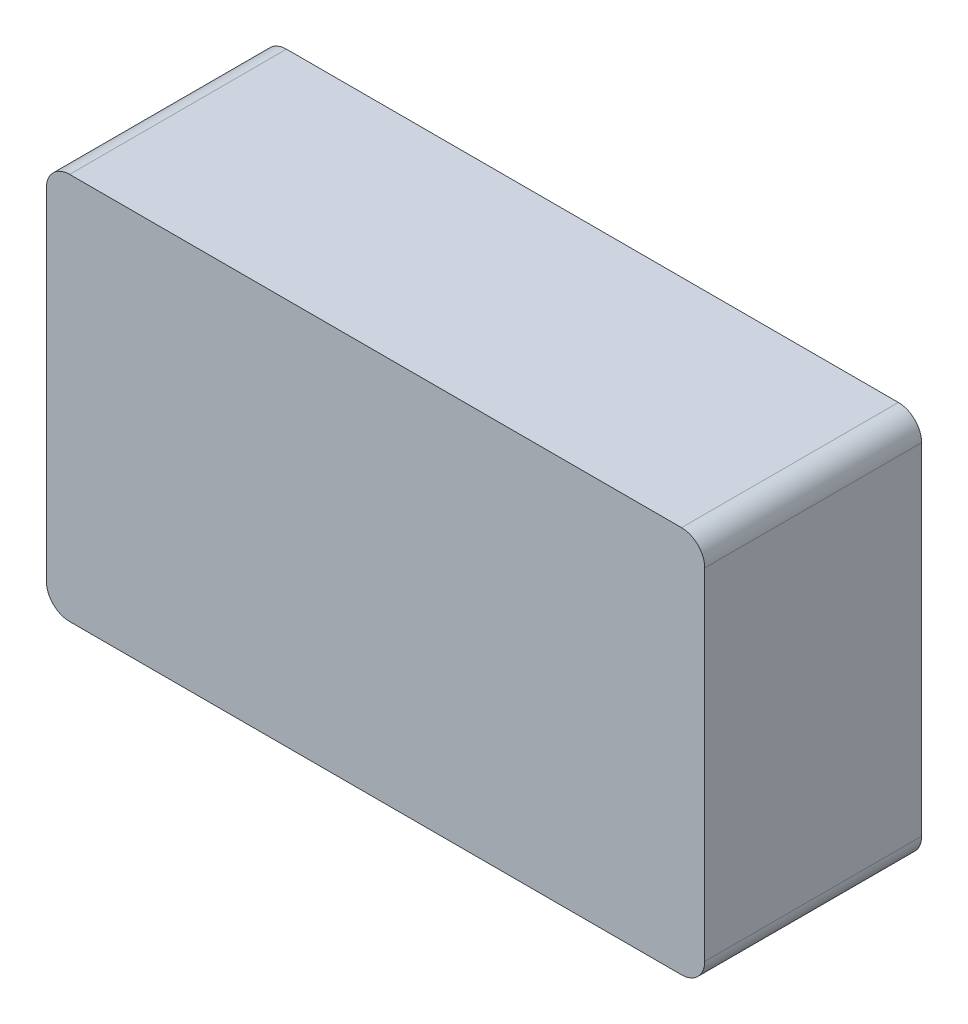
ISO-10303-21;
HEADER;
FILE_DESCRIPTION(('STEP AP214'),'2;1');
FILE_NAME('part.step','',(''),(''),'','','');
FILE_SCHEMA(('AUTOMOTIVE_DESIGN { 1 0 10303 214 1 1 1 1 }'));
ENDSEC;
DATA;
#1=APPLICATION_CONTEXT('core data for automotive mechanical design processes');
#2=APPLICATION_PROTOCOL_DEFINITION('international standard','automotive_design',2000,#1);
#3=PRODUCT_CONTEXT('',#1,'mechanical');
#4=PRODUCT('Part','Part','',(#3));
#5=PRODUCT_RELATED_PRODUCT_CATEGORY('part','',(#4));
#6=PRODUCT_DEFINITION_FORMATION('','',#4);
#7=PRODUCT_DEFINITION_CONTEXT('part definition',#1,'design');
#8=PRODUCT_DEFINITION('design','',#6,#7);
#9=PRODUCT_DEFINITION_SHAPE('','',#8);
#10=(LENGTH_UNIT() NAMED_UNIT(*) SI_UNIT(.MILLI.,.METRE.));
#11=(NAMED_UNIT(*) PLANE_ANGLE_UNIT() SI_UNIT($,.RADIAN.));
#12=(NAMED_UNIT(*) SI_UNIT($,.STERADIAN.) SOLID_ANGLE_UNIT());
#13=UNCERTAINTY_MEASURE_WITH_UNIT(LENGTH_MEASURE(1.E-05),#10,'distance_accuracy_value','');
#14=(GEOMETRIC_REPRESENTATION_CONTEXT(3) GLOBAL_UNCERTAINTY_ASSIGNED_CONTEXT((#13)) GLOBAL_UNIT_ASSIGNED_CONTEXT((#10,
#11,#12)) REPRESENTATION_CONTEXT('',''));
#15=CARTESIAN_POINT('',(0.,0.,0.));
#16=DIRECTION('',(0.,0.,1.));
#17=DIRECTION('',(1.,0.,0.));
#18=AXIS2_PLACEMENT_3D('',#15,#16,#17);
#19=CARTESIAN_POINT('',(0.,0.,28.));
#20=DIRECTION('',(1.,0.,0.));
#21=DIRECTION('',(0.,1.,0.));
#22=AXIS2_PLACEMENT_3D('',#19,#20,#21);
#23=PLANE('',#22);
#24=DIRECTION('',(0.,-1.,0.));
#25=VECTOR('',#24,1.);
#26=CARTESIAN_POINT('',(0.,0.,0.));
#27=LINE('',#26,#25);
#28=CARTESIAN_POINT('',(0.,-3.,0.));
#29=VERTEX_POINT('',#28);
#30=CARTESIAN_POINT('',(0.,-47.,0.));
#31=VERTEX_POINT('',#30);
#32=EDGE_CURVE('E126',#29,#31,#27,.T.);
#33=ORIENTED_EDGE('',*,*,#32,.T.);
#34=DIRECTION('',(0.,0.,-1.));
#35=VECTOR('',#34,1.);
#36=CARTESIAN_POINT('',(0.,-47.,28.));
#37=LINE('',#36,#35);
#38=CARTESIAN_POINT('',(0.,-47.,28.));
#39=VERTEX_POINT('',#38);
#40=EDGE_CURVE('E104',#31,#39,#37,.F.);
#41=ORIENTED_EDGE('',*,*,#40,.T.);
#42=DIRECTION('',(0.,-1.,0.));
#43=VECTOR('',#42,1.);
#44=CARTESIAN_POINT('',(0.,0.,28.));
#45=LINE('',#44,#43);
#46=CARTESIAN_POINT('',(0.,-3.,28.));
#47=VERTEX_POINT('',#46);
#48=EDGE_CURVE('E135',#47,#39,#45,.T.);
#49=ORIENTED_EDGE('',*,*,#48,.F.);
#50=DIRECTION('',(0.,0.,-1.));
#51=VECTOR('',#50,1.);
#52=CARTESIAN_POINT('',(0.,-3.,28.));
#53=LINE('',#52,#51);
#54=EDGE_CURVE('E109',#47,#29,#53,.T.);
#55=ORIENTED_EDGE('',*,*,#54,.T.);
#56=EDGE_LOOP('',(#33,#41,#49,#55));
#57=FACE_BOUND('',#56,.T.);
#58=ADVANCED_FACE('F33',(#57),#23,.F.);
#59=CARTESIAN_POINT('',(0.,-50.,28.));
#60=DIRECTION('',(0.,1.,0.));
#61=DIRECTION('',(0.,0.,1.));
#62=AXIS2_PLACEMENT_3D('',#59,#60,#61);
#63=PLANE('',#62);
#64=DIRECTION('',(1.,0.,0.));
#65=VECTOR('',#64,1.);
#66=CARTESIAN_POINT('',(0.,-50.,28.));
#67=LINE('',#66,#65);
#68=CARTESIAN_POINT('',(3.00000000000001,-50.,28.));
#69=VERTEX_POINT('',#68);
#70=CARTESIAN_POINT('',(82.,-50.,28.));
#71=VERTEX_POINT('',#70);
#72=EDGE_CURVE('E119',#69,#71,#67,.T.);
#73=ORIENTED_EDGE('',*,*,#72,.F.);
#74=DIRECTION('',(0.,0.,-1.));
#75=VECTOR('',#74,1.);
#76=CARTESIAN_POINT('',(3.00000000000001,-50.,28.));
#77=LINE('',#76,#75);
#78=CARTESIAN_POINT('',(3.00000000000001,-50.,0.));
#79=VERTEX_POINT('',#78);
#80=EDGE_CURVE('E103',#69,#79,#77,.T.);
#81=ORIENTED_EDGE('',*,*,#80,.T.);
#82=DIRECTION('',(1.,0.,0.));
#83=VECTOR('',#82,1.);
#84=CARTESIAN_POINT('',(0.,-50.,0.));
#85=LINE('',#84,#83);
#86=CARTESIAN_POINT('',(82.,-50.,0.));
#87=VERTEX_POINT('',#86);
#88=EDGE_CURVE('E116',#79,#87,#85,.T.);
#89=ORIENTED_EDGE('',*,*,#88,.T.);
#90=DIRECTION('',(0.,0.,-1.));
#91=VECTOR('',#90,1.);
#92=CARTESIAN_POINT('',(82.,-50.,28.));
#93=LINE('',#92,#91);
#94=EDGE_CURVE('E121',#87,#71,#93,.F.);
#95=ORIENTED_EDGE('',*,*,#94,.T.);
#96=EDGE_LOOP('',(#73,#81,#89,#95));
#97=FACE_BOUND('',#96,.T.);
#98=ADVANCED_FACE('F115',(#97),#63,.F.);
#99=CARTESIAN_POINT('',(85.,0.,28.));
#100=DIRECTION('',(-1.,0.,0.));
#101=DIRECTION('',(0.,0.,1.));
#102=AXIS2_PLACEMENT_3D('',#99,#100,#101);
#103=PLANE('',#102);
#104=DIRECTION('',(0.,1.,0.));
#105=VECTOR('',#104,1.);
#106=CARTESIAN_POINT('',(85.,0.,28.));
#107=LINE('',#106,#105);
#108=CARTESIAN_POINT('',(85.,-47.,28.));
#109=VERTEX_POINT('',#108);
#110=CARTESIAN_POINT('',(85.,-3.,28.));
#111=VERTEX_POINT('',#110);
#112=EDGE_CURVE('E161',#109,#111,#107,.T.);
#113=ORIENTED_EDGE('',*,*,#112,.F.);
#114=DIRECTION('',(0.,0.,-1.));
#115=VECTOR('',#114,1.);
#116=CARTESIAN_POINT('',(85.,-47.,28.));
#117=LINE('',#116,#115);
#118=CARTESIAN_POINT('',(85.,-47.,0.));
#119=VERTEX_POINT('',#118);
#120=EDGE_CURVE('E154',#109,#119,#117,.T.);
#121=ORIENTED_EDGE('',*,*,#120,.T.);
#122=DIRECTION('',(0.,1.,0.));
#123=VECTOR('',#122,1.);
#124=CARTESIAN_POINT('',(85.,0.,0.));
#125=LINE('',#124,#123);
#126=CARTESIAN_POINT('',(85.,-3.,0.));
#127=VERTEX_POINT('',#126);
#128=EDGE_CURVE('E125',#119,#127,#125,.T.);
#129=ORIENTED_EDGE('',*,*,#128,.T.);
#130=DIRECTION('',(0.,0.,-1.));
#131=VECTOR('',#130,1.);
#132=CARTESIAN_POINT('',(85.,-3.,28.));
#133=LINE('',#132,#131);
#134=EDGE_CURVE('E152',#127,#111,#133,.F.);
#135=ORIENTED_EDGE('',*,*,#134,.T.);
#136=EDGE_LOOP('',(#113,#121,#129,#135));
#137=FACE_BOUND('',#136,.T.);
#138=ADVANCED_FACE('F159',(#137),#103,.F.);
#139=CARTESIAN_POINT('',(0.,0.,28.));
#140=DIRECTION('',(0.,-1.,0.));
#141=DIRECTION('',(0.,0.,-1.));
#142=AXIS2_PLACEMENT_3D('',#139,#140,#141);
#143=PLANE('',#142);
#144=DIRECTION('',(-1.,0.,0.));
#145=VECTOR('',#144,1.);
#146=CARTESIAN_POINT('',(0.,0.,28.));
#147=LINE('',#146,#145);
#148=CARTESIAN_POINT('',(82.,0.,28.));
#149=VERTEX_POINT('',#148);
#150=CARTESIAN_POINT('',(3.,0.,28.));
#151=VERTEX_POINT('',#150);
#152=EDGE_CURVE('E136',#149,#151,#147,.T.);
#153=ORIENTED_EDGE('',*,*,#152,.F.);
#154=DIRECTION('',(0.,0.,-1.));
#155=VECTOR('',#154,1.);
#156=CARTESIAN_POINT('',(82.,0.,28.));
#157=LINE('',#156,#155);
#158=CARTESIAN_POINT('',(82.,0.,0.));
#159=VERTEX_POINT('',#158);
#160=EDGE_CURVE('E11',#149,#159,#157,.T.);
#161=ORIENTED_EDGE('',*,*,#160,.T.);
#162=DIRECTION('',(-1.,0.,0.));
#163=VECTOR('',#162,1.);
#164=CARTESIAN_POINT('',(0.,0.,0.));
#165=LINE('',#164,#163);
#166=CARTESIAN_POINT('',(3.,0.,0.));
#167=VERTEX_POINT('',#166);
#168=EDGE_CURVE('E129',#159,#167,#165,.T.);
#169=ORIENTED_EDGE('',*,*,#168,.T.);
#170=DIRECTION('',(0.,0.,-1.));
#171=VECTOR('',#170,1.);
#172=CARTESIAN_POINT('',(3.,0.,28.));
#173=LINE('',#172,#171);
#174=EDGE_CURVE('E41',#167,#151,#173,.F.);
#175=ORIENTED_EDGE('',*,*,#174,.T.);
#176=EDGE_LOOP('',(#153,#161,#169,#175));
#177=FACE_BOUND('',#176,.T.);
#178=ADVANCED_FACE('F168',(#177),#143,.F.);
#179=CARTESIAN_POINT('',(0.,0.,28.));
#180=DIRECTION('',(0.,0.,1.));
#181=DIRECTION('',(1.,0.,0.));
#182=AXIS2_PLACEMENT_3D('',#179,#180,#181);
#183=PLANE('',#182);
#184=ORIENTED_EDGE('',*,*,#48,.T.);
#185=CARTESIAN_POINT('',(3.00000000000001,-47.,28.));
#186=DIRECTION('',(0.,0.,1.));
#187=DIRECTION('',(1.,0.,0.));
#188=AXIS2_PLACEMENT_3D('',#185,#186,#187);
#189=CIRCLE('',#188,3.);
#190=EDGE_CURVE('E150',#39,#69,#189,.T.);
#191=ORIENTED_EDGE('',*,*,#190,.T.);
#192=ORIENTED_EDGE('',*,*,#72,.T.);
#193=CARTESIAN_POINT('',(82.,-47.,28.));
#194=DIRECTION('',(0.,0.,1.));
#195=DIRECTION('',(1.,0.,0.));
#196=AXIS2_PLACEMENT_3D('',#193,#194,#195);
#197=CIRCLE('',#196,3.);
#198=EDGE_CURVE('E148',#71,#109,#197,.T.);
#199=ORIENTED_EDGE('',*,*,#198,.T.);
#200=ORIENTED_EDGE('',*,*,#112,.T.);
#201=CARTESIAN_POINT('',(82.,-3.,28.));
#202=DIRECTION('',(0.,0.,1.));
#203=DIRECTION('',(1.,0.,0.));
#204=AXIS2_PLACEMENT_3D('',#201,#202,#203);
#205=CIRCLE('',#204,3.);
#206=EDGE_CURVE('E54',#111,#149,#205,.T.);
#207=ORIENTED_EDGE('',*,*,#206,.T.);
#208=ORIENTED_EDGE('',*,*,#152,.T.);
#209=CARTESIAN_POINT('',(3.,-3.,28.));
#210=DIRECTION('',(0.,0.,1.));
#211=DIRECTION('',(1.,0.,0.));
#212=AXIS2_PLACEMENT_3D('',#209,#210,#211);
#213=CIRCLE('',#212,3.);
#214=EDGE_CURVE('E145',#151,#47,#213,.T.);
#215=ORIENTED_EDGE('',*,*,#214,.T.);
#216=EDGE_LOOP('',(#184,#191,#192,#199,#200,#207,#208,#215));
#217=FACE_BOUND('',#216,.T.);
#218=ADVANCED_FACE('F175',(#217),#183,.T.);
#219=CARTESIAN_POINT('',(0.,0.,0.));
#220=DIRECTION('',(0.,0.,1.));
#221=DIRECTION('',(1.,0.,0.));
#222=AXIS2_PLACEMENT_3D('',#219,#220,#221);
#223=PLANE('',#222);
#224=ORIENTED_EDGE('',*,*,#88,.F.);
#225=CARTESIAN_POINT('',(3.00000000000001,-47.,0.));
#226=DIRECTION('',(0.,0.,1.));
#227=DIRECTION('',(1.,0.,0.));
#228=AXIS2_PLACEMENT_3D('',#225,#226,#227);
#229=CIRCLE('',#228,3.);
#230=EDGE_CURVE('E99',#79,#31,#229,.F.);
#231=ORIENTED_EDGE('',*,*,#230,.T.);
#232=ORIENTED_EDGE('',*,*,#32,.F.);
#233=CARTESIAN_POINT('',(3.,-3.,0.));
#234=DIRECTION('',(0.,0.,1.));
#235=DIRECTION('',(1.,0.,0.));
#236=AXIS2_PLACEMENT_3D('',#233,#234,#235);
#237=CIRCLE('',#236,3.);
#238=EDGE_CURVE('E120',#29,#167,#237,.F.);
#239=ORIENTED_EDGE('',*,*,#238,.T.);
#240=ORIENTED_EDGE('',*,*,#168,.F.);
#241=CARTESIAN_POINT('',(82.,-3.,0.));
#242=DIRECTION('',(0.,0.,1.));
#243=DIRECTION('',(1.,0.,0.));
#244=AXIS2_PLACEMENT_3D('',#241,#242,#243);
#245=CIRCLE('',#244,3.);
#246=EDGE_CURVE('E139',#159,#127,#245,.F.);
#247=ORIENTED_EDGE('',*,*,#246,.T.);
#248=ORIENTED_EDGE('',*,*,#128,.F.);
#249=CARTESIAN_POINT('',(82.,-47.,0.));
#250=DIRECTION('',(0.,0.,1.));
#251=DIRECTION('',(1.,0.,0.));
#252=AXIS2_PLACEMENT_3D('',#249,#250,#251);
#253=CIRCLE('',#252,3.);
#254=EDGE_CURVE('E110',#119,#87,#253,.F.);
#255=ORIENTED_EDGE('',*,*,#254,.T.);
#256=EDGE_LOOP('',(#224,#231,#232,#239,#240,#247,#248,#255));
#257=FACE_BOUND('',#256,.T.);
#258=ADVANCED_FACE('F123',(#257),#223,.F.);
#259=CARTESIAN_POINT('',(3.00000000000001,-47.,28.));
#260=DIRECTION('',(0.,0.,-1.));
#261=DIRECTION('',(-1.,0.,0.));
#262=AXIS2_PLACEMENT_3D('',#259,#260,#261);
#263=CYLINDRICAL_SURFACE('',#262,3.);
#264=ORIENTED_EDGE('',*,*,#190,.F.);
#265=ORIENTED_EDGE('',*,*,#40,.F.);
#266=ORIENTED_EDGE('',*,*,#230,.F.);
#267=ORIENTED_EDGE('',*,*,#80,.F.);
#268=EDGE_LOOP('',(#264,#265,#266,#267));
#269=FACE_BOUND('',#268,.T.);
#270=ADVANCED_FACE('F102',(#269),#263,.T.);
#271=CARTESIAN_POINT('',(82.,-47.,28.));
#272=DIRECTION('',(0.,0.,-1.));
#273=DIRECTION('',(-1.,0.,0.));
#274=AXIS2_PLACEMENT_3D('',#271,#272,#273);
#275=CYLINDRICAL_SURFACE('',#274,3.);
#276=ORIENTED_EDGE('',*,*,#198,.F.);
#277=ORIENTED_EDGE('',*,*,#94,.F.);
#278=ORIENTED_EDGE('',*,*,#254,.F.);
#279=ORIENTED_EDGE('',*,*,#120,.F.);
#280=EDGE_LOOP('',(#276,#277,#278,#279));
#281=FACE_BOUND('',#280,.T.);
#282=ADVANCED_FACE('F183',(#281),#275,.T.);
#283=CARTESIAN_POINT('',(82.,-3.,28.));
#284=DIRECTION('',(0.,0.,-1.));
#285=DIRECTION('',(-1.,0.,0.));
#286=AXIS2_PLACEMENT_3D('',#283,#284,#285);
#287=CYLINDRICAL_SURFACE('',#286,3.);
#288=ORIENTED_EDGE('',*,*,#206,.F.);
#289=ORIENTED_EDGE('',*,*,#134,.F.);
#290=ORIENTED_EDGE('',*,*,#246,.F.);
#291=ORIENTED_EDGE('',*,*,#160,.F.);
#292=EDGE_LOOP('',(#288,#289,#290,#291));
#293=FACE_BOUND('',#292,.T.);
#294=ADVANCED_FACE('F167',(#293),#287,.T.);
#295=CARTESIAN_POINT('',(3.,-3.,28.));
#296=DIRECTION('',(0.,0.,-1.));
#297=DIRECTION('',(-1.,0.,0.));
#298=AXIS2_PLACEMENT_3D('',#295,#296,#297);
#299=CYLINDRICAL_SURFACE('',#298,3.);
#300=ORIENTED_EDGE('',*,*,#214,.F.);
#301=ORIENTED_EDGE('',*,*,#174,.F.);
#302=ORIENTED_EDGE('',*,*,#238,.F.);
#303=ORIENTED_EDGE('',*,*,#54,.F.);
#304=EDGE_LOOP('',(#300,#301,#302,#303));
#305=FACE_BOUND('',#304,.T.);
#306=ADVANCED_FACE('F35',(#305),#299,.T.);
#307=CLOSED_SHELL('',(#58,#98,#138,#178,#218,#258,#270,#282,#294,#306));
#308=MANIFOLD_SOLID_BREP('B2',#307);
#309=ADVANCED_BREP_SHAPE_REPRESENTATION('',(#18,#308),#14);
#310=SHAPE_DEFINITION_REPRESENTATION(#9,#309);
ENDSEC;
END-ISO-10303-21;
